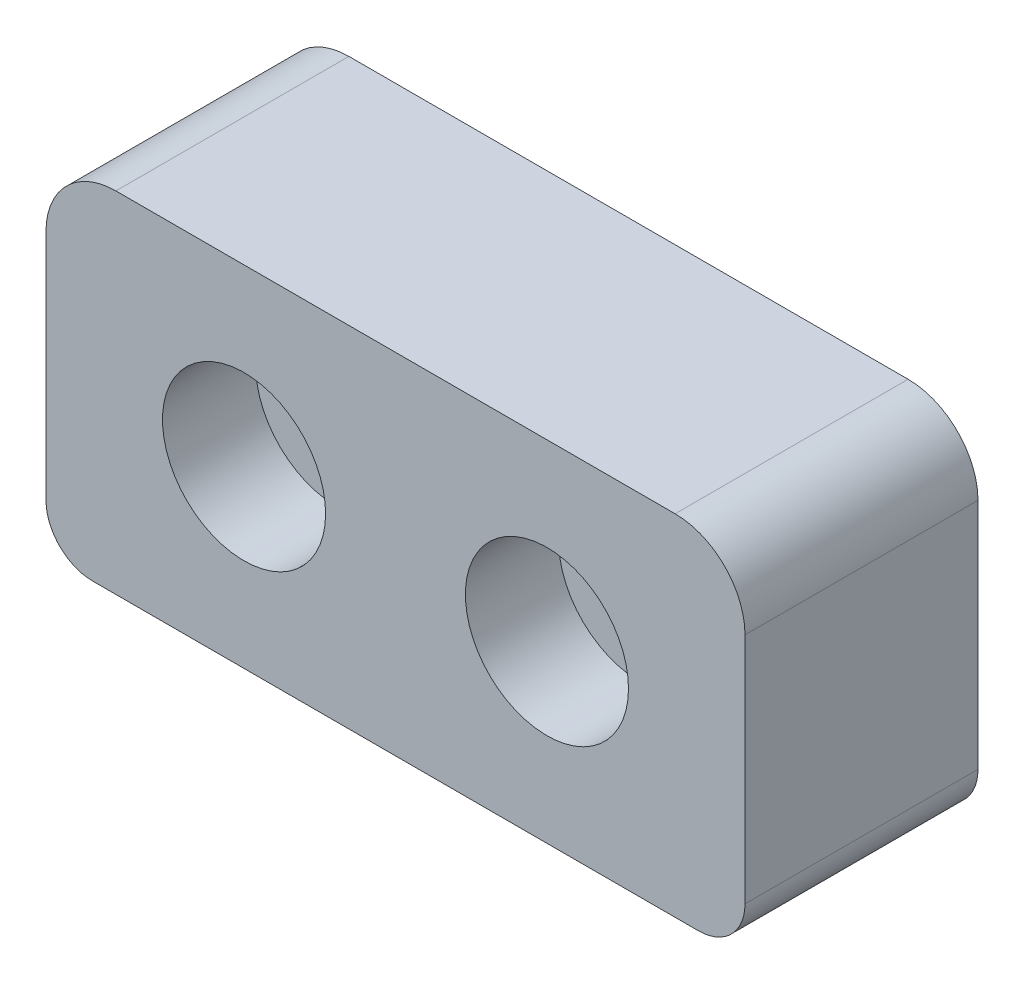
ISO-10303-21;
HEADER;
FILE_DESCRIPTION(('STEP AP214'),'2;1');
FILE_NAME('part.step','',(''),(''),'','','');
FILE_SCHEMA(('AUTOMOTIVE_DESIGN { 1 0 10303 214 1 1 1 1 }'));
ENDSEC;
DATA;
#1=APPLICATION_CONTEXT('core data for automotive mechanical design processes');
#2=APPLICATION_PROTOCOL_DEFINITION('international standard','automotive_design',2000,#1);
#3=PRODUCT_CONTEXT('',#1,'mechanical');
#4=PRODUCT('Part','Part','',(#3));
#5=PRODUCT_RELATED_PRODUCT_CATEGORY('part','',(#4));
#6=PRODUCT_DEFINITION_FORMATION('','',#4);
#7=PRODUCT_DEFINITION_CONTEXT('part definition',#1,'design');
#8=PRODUCT_DEFINITION('design','',#6,#7);
#9=PRODUCT_DEFINITION_SHAPE('','',#8);
#10=(LENGTH_UNIT() NAMED_UNIT(*) SI_UNIT(.MILLI.,.METRE.));
#11=(NAMED_UNIT(*) PLANE_ANGLE_UNIT() SI_UNIT($,.RADIAN.));
#12=(NAMED_UNIT(*) SI_UNIT($,.STERADIAN.) SOLID_ANGLE_UNIT());
#13=UNCERTAINTY_MEASURE_WITH_UNIT(LENGTH_MEASURE(1.E-05),#10,'distance_accuracy_value','');
#14=(GEOMETRIC_REPRESENTATION_CONTEXT(3) GLOBAL_UNCERTAINTY_ASSIGNED_CONTEXT((#13)) GLOBAL_UNIT_ASSIGNED_CONTEXT((#10,
#11,#12)) REPRESENTATION_CONTEXT('',''));
#15=CARTESIAN_POINT('',(0.,0.,0.));
#16=DIRECTION('',(0.,0.,1.));
#17=DIRECTION('',(1.,0.,0.));
#18=AXIS2_PLACEMENT_3D('',#15,#16,#17);
#19=CARTESIAN_POINT('',(6.5,-7.5,0.));
#20=DIRECTION('',(0.,0.,1.));
#21=DIRECTION('',(1.,0.,0.));
#22=AXIS2_PLACEMENT_3D('',#19,#20,#21);
#23=CYLINDRICAL_SURFACE('',#22,1.55);
#24=CARTESIAN_POINT('',(6.5,-7.5,0.));
#25=DIRECTION('',(0.,0.,1.));
#26=DIRECTION('',(-1.,0.,0.));
#27=AXIS2_PLACEMENT_3D('',#24,#25,#26);
#28=CIRCLE('',#27,1.55);
#29=CARTESIAN_POINT('',(4.95,-7.5,0.));
#30=VERTEX_POINT('',#29);
#31=EDGE_CURVE('E168',#30,#30,#28,.T.);
#32=ORIENTED_EDGE('',*,*,#31,.F.);
#33=EDGE_LOOP('',(#32));
#34=FACE_BOUND('',#33,.T.);
#35=CARTESIAN_POINT('',(6.5,-7.5,6.));
#36=DIRECTION('',(0.,0.,1.));
#37=DIRECTION('',(1.,0.,0.));
#38=AXIS2_PLACEMENT_3D('',#35,#36,#37);
#39=CIRCLE('',#38,1.55);
#40=CARTESIAN_POINT('',(8.05,-7.5,6.));
#41=VERTEX_POINT('',#40);
#42=EDGE_CURVE('E40',#41,#41,#39,.F.);
#43=ORIENTED_EDGE('',*,*,#42,.F.);
#44=EDGE_LOOP('',(#43));
#45=FACE_BOUND('',#44,.T.);
#46=ADVANCED_FACE('F36',(#34,#45),#23,.F.);
#47=CARTESIAN_POINT('',(-6.5,-7.5,0.));
#48=DIRECTION('',(0.,0.,1.));
#49=DIRECTION('',(1.,0.,0.));
#50=AXIS2_PLACEMENT_3D('',#47,#48,#49);
#51=CYLINDRICAL_SURFACE('',#50,1.55);
#52=CARTESIAN_POINT('',(-6.5,-7.5,0.));
#53=DIRECTION('',(0.,0.,1.));
#54=DIRECTION('',(1.,0.,0.));
#55=AXIS2_PLACEMENT_3D('',#52,#53,#54);
#56=CIRCLE('',#55,1.55);
#57=CARTESIAN_POINT('',(-4.95,-7.5,0.));
#58=VERTEX_POINT('',#57);
#59=EDGE_CURVE('E132',#58,#58,#56,.T.);
#60=ORIENTED_EDGE('',*,*,#59,.F.);
#61=EDGE_LOOP('',(#60));
#62=FACE_BOUND('',#61,.T.);
#63=CARTESIAN_POINT('',(-6.5,-7.5,6.));
#64=DIRECTION('',(0.,0.,1.));
#65=DIRECTION('',(1.,0.,0.));
#66=AXIS2_PLACEMENT_3D('',#63,#64,#65);
#67=CIRCLE('',#66,1.55);
#68=CARTESIAN_POINT('',(-4.95,-7.5,6.));
#69=VERTEX_POINT('',#68);
#70=EDGE_CURVE('E162',#69,#69,#67,.F.);
#71=ORIENTED_EDGE('',*,*,#70,.F.);
#72=EDGE_LOOP('',(#71));
#73=FACE_BOUND('',#72,.T.);
#74=ADVANCED_FACE('F221',(#62,#73),#51,.F.);
#75=CARTESIAN_POINT('',(-15.,5.,10.));
#76=DIRECTION('',(1.,0.,0.));
#77=DIRECTION('',(0.,1.,0.));
#78=AXIS2_PLACEMENT_3D('',#75,#76,#77);
#79=PLANE('',#78);
#80=DIRECTION('',(0.,-1.,0.));
#81=VECTOR('',#80,1.);
#82=CARTESIAN_POINT('',(-15.,5.,10.));
#83=LINE('',#82,#81);
#84=CARTESIAN_POINT('',(-15.,-3.,10.));
#85=VERTEX_POINT('',#84);
#86=CARTESIAN_POINT('',(-15.,-13.,10.));
#87=VERTEX_POINT('',#86);
#88=EDGE_CURVE('E137',#85,#87,#83,.T.);
#89=ORIENTED_EDGE('',*,*,#88,.F.);
#90=DIRECTION('',(0.,0.,1.));
#91=VECTOR('',#90,1.);
#92=CARTESIAN_POINT('',(-15.,-3.,10.));
#93=LINE('',#92,#91);
#94=CARTESIAN_POINT('',(-15.,-3.,0.));
#95=VERTEX_POINT('',#94);
#96=EDGE_CURVE('E11',#85,#95,#93,.F.);
#97=ORIENTED_EDGE('',*,*,#96,.T.);
#98=DIRECTION('',(0.,-1.,0.));
#99=VECTOR('',#98,1.);
#100=CARTESIAN_POINT('',(-15.,5.,0.));
#101=LINE('',#100,#99);
#102=CARTESIAN_POINT('',(-15.,-13.,0.));
#103=VERTEX_POINT('',#102);
#104=EDGE_CURVE('E127',#95,#103,#101,.T.);
#105=ORIENTED_EDGE('',*,*,#104,.T.);
#106=DIRECTION('',(0.,0.,-1.));
#107=VECTOR('',#106,1.);
#108=CARTESIAN_POINT('',(-15.,-13.,10.));
#109=LINE('',#108,#107);
#110=EDGE_CURVE('E110',#103,#87,#109,.F.);
#111=ORIENTED_EDGE('',*,*,#110,.T.);
#112=EDGE_LOOP('',(#89,#97,#105,#111));
#113=FACE_BOUND('',#112,.T.);
#114=ADVANCED_FACE('F210',(#113),#79,.F.);
#115=CARTESIAN_POINT('',(15.,-15.,10.));
#116=DIRECTION('',(0.,1.,0.));
#117=DIRECTION('',(-1.,0.,0.));
#118=AXIS2_PLACEMENT_3D('',#115,#116,#117);
#119=PLANE('',#118);
#120=DIRECTION('',(1.,0.,0.));
#121=VECTOR('',#120,1.);
#122=CARTESIAN_POINT('',(15.,-15.,10.));
#123=LINE('',#122,#121);
#124=CARTESIAN_POINT('',(-13.,-15.,10.));
#125=VERTEX_POINT('',#124);
#126=CARTESIAN_POINT('',(13.,-15.,10.));
#127=VERTEX_POINT('',#126);
#128=EDGE_CURVE('E121',#125,#127,#123,.T.);
#129=ORIENTED_EDGE('',*,*,#128,.F.);
#130=DIRECTION('',(0.,0.,-1.));
#131=VECTOR('',#130,1.);
#132=CARTESIAN_POINT('',(-13.,-15.,10.));
#133=LINE('',#132,#131);
#134=CARTESIAN_POINT('',(-13.,-15.,0.));
#135=VERTEX_POINT('',#134);
#136=EDGE_CURVE('E108',#125,#135,#133,.T.);
#137=ORIENTED_EDGE('',*,*,#136,.T.);
#138=DIRECTION('',(1.,0.,0.));
#139=VECTOR('',#138,1.);
#140=CARTESIAN_POINT('',(15.,-15.,0.));
#141=LINE('',#140,#139);
#142=CARTESIAN_POINT('',(13.,-15.,0.));
#143=VERTEX_POINT('',#142);
#144=EDGE_CURVE('E118',#135,#143,#141,.T.);
#145=ORIENTED_EDGE('',*,*,#144,.T.);
#146=DIRECTION('',(0.,0.,-1.));
#147=VECTOR('',#146,1.);
#148=CARTESIAN_POINT('',(13.,-15.,10.));
#149=LINE('',#148,#147);
#150=EDGE_CURVE('E122',#143,#127,#149,.F.);
#151=ORIENTED_EDGE('',*,*,#150,.T.);
#152=EDGE_LOOP('',(#129,#137,#145,#151));
#153=FACE_BOUND('',#152,.T.);
#154=ADVANCED_FACE('F117',(#153),#119,.F.);
#155=CARTESIAN_POINT('',(15.,5.,10.));
#156=DIRECTION('',(-1.,0.,0.));
#157=DIRECTION('',(0.,-1.,0.));
#158=AXIS2_PLACEMENT_3D('',#155,#156,#157);
#159=PLANE('',#158);
#160=DIRECTION('',(0.,1.,0.));
#161=VECTOR('',#160,1.);
#162=CARTESIAN_POINT('',(15.,5.,0.));
#163=LINE('',#162,#161);
#164=CARTESIAN_POINT('',(15.,-13.,0.));
#165=VERTEX_POINT('',#164);
#166=CARTESIAN_POINT('',(15.,-3.,0.));
#167=VERTEX_POINT('',#166);
#168=EDGE_CURVE('E126',#165,#167,#163,.T.);
#169=ORIENTED_EDGE('',*,*,#168,.T.);
#170=DIRECTION('',(0.,0.,1.));
#171=VECTOR('',#170,1.);
#172=CARTESIAN_POINT('',(15.,-3.,10.));
#173=LINE('',#172,#171);
#174=CARTESIAN_POINT('',(15.,-3.,10.));
#175=VERTEX_POINT('',#174);
#176=EDGE_CURVE('E149',#167,#175,#173,.T.);
#177=ORIENTED_EDGE('',*,*,#176,.T.);
#178=DIRECTION('',(0.,1.,0.));
#179=VECTOR('',#178,1.);
#180=CARTESIAN_POINT('',(15.,5.,10.));
#181=LINE('',#180,#179);
#182=CARTESIAN_POINT('',(15.,-13.,10.));
#183=VERTEX_POINT('',#182);
#184=EDGE_CURVE('E189',#183,#175,#181,.T.);
#185=ORIENTED_EDGE('',*,*,#184,.F.);
#186=DIRECTION('',(0.,0.,-1.));
#187=VECTOR('',#186,1.);
#188=CARTESIAN_POINT('',(15.,-13.,10.));
#189=LINE('',#188,#187);
#190=EDGE_CURVE('E146',#183,#165,#189,.T.);
#191=ORIENTED_EDGE('',*,*,#190,.T.);
#192=EDGE_LOOP('',(#169,#177,#185,#191));
#193=FACE_BOUND('',#192,.T.);
#194=ADVANCED_FACE('F204',(#193),#159,.F.);
#195=CARTESIAN_POINT('',(7.25,0.,10.));
#196=DIRECTION('',(0.,-1.,0.));
#197=DIRECTION('',(1.,0.,0.));
#198=AXIS2_PLACEMENT_3D('',#195,#196,#197);
#199=PLANE('',#198);
#200=DIRECTION('',(-1.,0.,0.));
#201=VECTOR('',#200,1.);
#202=CARTESIAN_POINT('',(7.25,0.,10.));
#203=LINE('',#202,#201);
#204=CARTESIAN_POINT('',(12.,0.,10.));
#205=VERTEX_POINT('',#204);
#206=CARTESIAN_POINT('',(-12.,0.,10.));
#207=VERTEX_POINT('',#206);
#208=EDGE_CURVE('E138',#205,#207,#203,.T.);
#209=ORIENTED_EDGE('',*,*,#208,.F.);
#210=DIRECTION('',(0.,0.,1.));
#211=VECTOR('',#210,1.);
#212=CARTESIAN_POINT('',(12.,0.,10.));
#213=LINE('',#212,#211);
#214=CARTESIAN_POINT('',(12.,0.,0.));
#215=VERTEX_POINT('',#214);
#216=EDGE_CURVE('E159',#205,#215,#213,.F.);
#217=ORIENTED_EDGE('',*,*,#216,.T.);
#218=DIRECTION('',(-1.,0.,0.));
#219=VECTOR('',#218,1.);
#220=CARTESIAN_POINT('',(7.25,0.,0.));
#221=LINE('',#220,#219);
#222=CARTESIAN_POINT('',(-12.,0.,0.));
#223=VERTEX_POINT('',#222);
#224=EDGE_CURVE('E130',#215,#223,#221,.T.);
#225=ORIENTED_EDGE('',*,*,#224,.T.);
#226=DIRECTION('',(0.,0.,1.));
#227=VECTOR('',#226,1.);
#228=CARTESIAN_POINT('',(-12.,0.,10.));
#229=LINE('',#228,#227);
#230=EDGE_CURVE('E156',#223,#207,#229,.T.);
#231=ORIENTED_EDGE('',*,*,#230,.T.);
#232=EDGE_LOOP('',(#209,#217,#225,#231));
#233=FACE_BOUND('',#232,.T.);
#234=ADVANCED_FACE('F197',(#233),#199,.F.);
#235=CARTESIAN_POINT('',(0.,0.,10.));
#236=DIRECTION('',(0.,0.,1.));
#237=DIRECTION('',(1.,0.,0.));
#238=AXIS2_PLACEMENT_3D('',#235,#236,#237);
#239=PLANE('',#238);
#240=CARTESIAN_POINT('',(-6.50000000000482,-7.50000000050165,10.));
#241=DIRECTION('',(0.,0.,1.));
#242=DIRECTION('',(1.,0.,0.));
#243=AXIS2_PLACEMENT_3D('',#240,#241,#242);
#244=CIRCLE('',#243,3.50000000007501);
#245=CARTESIAN_POINT('',(-2.9999999999298,-7.50000000050165,10.));
#246=VERTEX_POINT('',#245);
#247=EDGE_CURVE('E170',#246,#246,#244,.T.);
#248=ORIENTED_EDGE('',*,*,#247,.F.);
#249=EDGE_LOOP('',(#248));
#250=FACE_BOUND('',#249,.T.);
#251=CARTESIAN_POINT('',(6.5,-7.5,10.));
#252=DIRECTION('',(0.,0.,1.));
#253=DIRECTION('',(1.,0.,0.));
#254=AXIS2_PLACEMENT_3D('',#251,#252,#253);
#255=CIRCLE('',#254,3.5);
#256=CARTESIAN_POINT('',(10.,-7.5,10.));
#257=VERTEX_POINT('',#256);
#258=EDGE_CURVE('E180',#257,#257,#255,.T.);
#259=ORIENTED_EDGE('',*,*,#258,.F.);
#260=EDGE_LOOP('',(#259));
#261=FACE_BOUND('',#260,.T.);
#262=ORIENTED_EDGE('',*,*,#184,.T.);
#263=CARTESIAN_POINT('',(12.,-3.,10.));
#264=DIRECTION('',(0.,0.,1.));
#265=DIRECTION('',(1.,0.,0.));
#266=AXIS2_PLACEMENT_3D('',#263,#264,#265);
#267=CIRCLE('',#266,3.);
#268=EDGE_CURVE('E154',#175,#205,#267,.T.);
#269=ORIENTED_EDGE('',*,*,#268,.T.);
#270=ORIENTED_EDGE('',*,*,#208,.T.);
#271=CARTESIAN_POINT('',(-12.,-3.,10.));
#272=DIRECTION('',(0.,0.,1.));
#273=DIRECTION('',(1.,0.,0.));
#274=AXIS2_PLACEMENT_3D('',#271,#272,#273);
#275=CIRCLE('',#274,3.);
#276=EDGE_CURVE('E152',#207,#85,#275,.T.);
#277=ORIENTED_EDGE('',*,*,#276,.T.);
#278=ORIENTED_EDGE('',*,*,#88,.T.);
#279=CARTESIAN_POINT('',(-13.,-13.,10.));
#280=DIRECTION('',(0.,0.,1.));
#281=DIRECTION('',(1.,0.,0.));
#282=AXIS2_PLACEMENT_3D('',#279,#280,#281);
#283=CIRCLE('',#282,2.);
#284=EDGE_CURVE('E144',#87,#125,#283,.T.);
#285=ORIENTED_EDGE('',*,*,#284,.T.);
#286=ORIENTED_EDGE('',*,*,#128,.T.);
#287=CARTESIAN_POINT('',(13.,-13.,10.));
#288=DIRECTION('',(0.,0.,1.));
#289=DIRECTION('',(1.,0.,0.));
#290=AXIS2_PLACEMENT_3D('',#287,#288,#289);
#291=CIRCLE('',#290,2.);
#292=EDGE_CURVE('E142',#127,#183,#291,.T.);
#293=ORIENTED_EDGE('',*,*,#292,.T.);
#294=EDGE_LOOP('',(#262,#269,#270,#277,#278,#285,#286,#293));
#295=FACE_BOUND('',#294,.T.);
#296=ADVANCED_FACE('F194',(#250,#261,#295),#239,.T.);
#297=CARTESIAN_POINT('',(0.,0.,0.));
#298=DIRECTION('',(0.,0.,1.));
#299=DIRECTION('',(1.,0.,0.));
#300=AXIS2_PLACEMENT_3D('',#297,#298,#299);
#301=PLANE('',#300);
#302=ORIENTED_EDGE('',*,*,#59,.T.);
#303=EDGE_LOOP('',(#302));
#304=FACE_BOUND('',#303,.T.);
#305=ORIENTED_EDGE('',*,*,#31,.T.);
#306=EDGE_LOOP('',(#305));
#307=FACE_BOUND('',#306,.T.);
#308=ORIENTED_EDGE('',*,*,#224,.F.);
#309=CARTESIAN_POINT('',(12.,-3.,0.));
#310=DIRECTION('',(0.,0.,1.));
#311=DIRECTION('',(1.,0.,0.));
#312=AXIS2_PLACEMENT_3D('',#309,#310,#311);
#313=CIRCLE('',#312,3.);
#314=EDGE_CURVE('E45',#215,#167,#313,.F.);
#315=ORIENTED_EDGE('',*,*,#314,.T.);
#316=ORIENTED_EDGE('',*,*,#168,.F.);
#317=CARTESIAN_POINT('',(13.,-13.,0.));
#318=DIRECTION('',(0.,0.,1.));
#319=DIRECTION('',(1.,0.,0.));
#320=AXIS2_PLACEMENT_3D('',#317,#318,#319);
#321=CIRCLE('',#320,2.);
#322=EDGE_CURVE('E112',#165,#143,#321,.F.);
#323=ORIENTED_EDGE('',*,*,#322,.T.);
#324=ORIENTED_EDGE('',*,*,#144,.F.);
#325=CARTESIAN_POINT('',(-13.,-13.,0.));
#326=DIRECTION('',(0.,0.,1.));
#327=DIRECTION('',(1.,0.,0.));
#328=AXIS2_PLACEMENT_3D('',#325,#326,#327);
#329=CIRCLE('',#328,2.);
#330=EDGE_CURVE('E104',#135,#103,#329,.F.);
#331=ORIENTED_EDGE('',*,*,#330,.T.);
#332=ORIENTED_EDGE('',*,*,#104,.F.);
#333=CARTESIAN_POINT('',(-12.,-3.,0.));
#334=DIRECTION('',(0.,0.,1.));
#335=DIRECTION('',(1.,0.,0.));
#336=AXIS2_PLACEMENT_3D('',#333,#334,#335);
#337=CIRCLE('',#336,3.);
#338=EDGE_CURVE('E58',#95,#223,#337,.F.);
#339=ORIENTED_EDGE('',*,*,#338,.T.);
#340=EDGE_LOOP('',(#308,#315,#316,#323,#324,#331,#332,#339));
#341=FACE_BOUND('',#340,.T.);
#342=ADVANCED_FACE('F124',(#304,#307,#341),#301,.F.);
#343=CARTESIAN_POINT('',(-13.,-13.,10.));
#344=DIRECTION('',(0.,0.,-1.));
#345=DIRECTION('',(-1.,0.,0.));
#346=AXIS2_PLACEMENT_3D('',#343,#344,#345);
#347=CYLINDRICAL_SURFACE('',#346,2.);
#348=ORIENTED_EDGE('',*,*,#284,.F.);
#349=ORIENTED_EDGE('',*,*,#110,.F.);
#350=ORIENTED_EDGE('',*,*,#330,.F.);
#351=ORIENTED_EDGE('',*,*,#136,.F.);
#352=EDGE_LOOP('',(#348,#349,#350,#351));
#353=FACE_BOUND('',#352,.T.);
#354=ADVANCED_FACE('F107',(#353),#347,.T.);
#355=CARTESIAN_POINT('',(13.,-13.,10.));
#356=DIRECTION('',(0.,0.,-1.));
#357=DIRECTION('',(-1.,0.,0.));
#358=AXIS2_PLACEMENT_3D('',#355,#356,#357);
#359=CYLINDRICAL_SURFACE('',#358,2.);
#360=ORIENTED_EDGE('',*,*,#292,.F.);
#361=ORIENTED_EDGE('',*,*,#150,.F.);
#362=ORIENTED_EDGE('',*,*,#322,.F.);
#363=ORIENTED_EDGE('',*,*,#190,.F.);
#364=EDGE_LOOP('',(#360,#361,#362,#363));
#365=FACE_BOUND('',#364,.T.);
#366=ADVANCED_FACE('F209',(#365),#359,.T.);
#367=CARTESIAN_POINT('',(12.,-3.,10.));
#368=DIRECTION('',(0.,0.,1.));
#369=DIRECTION('',(1.,0.,0.));
#370=AXIS2_PLACEMENT_3D('',#367,#368,#369);
#371=CYLINDRICAL_SURFACE('',#370,3.);
#372=ORIENTED_EDGE('',*,*,#314,.F.);
#373=ORIENTED_EDGE('',*,*,#216,.F.);
#374=ORIENTED_EDGE('',*,*,#268,.F.);
#375=ORIENTED_EDGE('',*,*,#176,.F.);
#376=EDGE_LOOP('',(#372,#373,#374,#375));
#377=FACE_BOUND('',#376,.T.);
#378=ADVANCED_FACE('F201',(#377),#371,.T.);
#379=CARTESIAN_POINT('',(-12.,-3.,10.));
#380=DIRECTION('',(0.,0.,1.));
#381=DIRECTION('',(1.,0.,0.));
#382=AXIS2_PLACEMENT_3D('',#379,#380,#381);
#383=CYLINDRICAL_SURFACE('',#382,3.);
#384=ORIENTED_EDGE('',*,*,#338,.F.);
#385=ORIENTED_EDGE('',*,*,#96,.F.);
#386=ORIENTED_EDGE('',*,*,#276,.F.);
#387=ORIENTED_EDGE('',*,*,#230,.F.);
#388=EDGE_LOOP('',(#384,#385,#386,#387));
#389=FACE_BOUND('',#388,.T.);
#390=ADVANCED_FACE('F38',(#389),#383,.T.);
#391=CARTESIAN_POINT('',(-6.50000000000482,-7.50000000050165,6.));
#392=DIRECTION('',(0.,0.,1.));
#393=DIRECTION('',(1.,0.,0.));
#394=AXIS2_PLACEMENT_3D('',#391,#392,#393);
#395=PLANE('',#394);
#396=CARTESIAN_POINT('',(-6.50000000000482,-7.50000000050165,6.));
#397=DIRECTION('',(0.,0.,1.));
#398=DIRECTION('',(1.,0.,0.));
#399=AXIS2_PLACEMENT_3D('',#396,#397,#398);
#400=CIRCLE('',#399,3.50000000007501);
#401=CARTESIAN_POINT('',(-2.9999999999298,-7.50000000050165,6.));
#402=VERTEX_POINT('',#401);
#403=EDGE_CURVE('E164',#402,#402,#400,.T.);
#404=ORIENTED_EDGE('',*,*,#403,.T.);
#405=EDGE_LOOP('',(#404));
#406=FACE_BOUND('',#405,.T.);
#407=ORIENTED_EDGE('',*,*,#70,.T.);
#408=EDGE_LOOP('',(#407));
#409=FACE_BOUND('',#408,.T.);
#410=ADVANCED_FACE('F213',(#406,#409),#395,.T.);
#411=CARTESIAN_POINT('',(-6.50000000000482,-7.50000000050165,6.));
#412=DIRECTION('',(0.,0.,1.));
#413=DIRECTION('',(1.,0.,0.));
#414=AXIS2_PLACEMENT_3D('',#411,#412,#413);
#415=CYLINDRICAL_SURFACE('',#414,3.50000000007501);
#416=ORIENTED_EDGE('',*,*,#403,.F.);
#417=EDGE_LOOP('',(#416));
#418=FACE_BOUND('',#417,.T.);
#419=ORIENTED_EDGE('',*,*,#247,.T.);
#420=EDGE_LOOP('',(#419));
#421=FACE_BOUND('',#420,.T.);
#422=ADVANCED_FACE('F218',(#418,#421),#415,.F.);
#423=CARTESIAN_POINT('',(6.5,-7.5,6.));
#424=DIRECTION('',(0.,0.,1.));
#425=DIRECTION('',(1.,0.,0.));
#426=AXIS2_PLACEMENT_3D('',#423,#424,#425);
#427=PLANE('',#426);
#428=CARTESIAN_POINT('',(6.5,-7.5,6.));
#429=DIRECTION('',(0.,0.,1.));
#430=DIRECTION('',(1.,0.,0.));
#431=AXIS2_PLACEMENT_3D('',#428,#429,#430);
#432=CIRCLE('',#431,3.5);
#433=CARTESIAN_POINT('',(10.,-7.5,6.));
#434=VERTEX_POINT('',#433);
#435=EDGE_CURVE('E175',#434,#434,#432,.T.);
#436=ORIENTED_EDGE('',*,*,#435,.T.);
#437=EDGE_LOOP('',(#436));
#438=FACE_BOUND('',#437,.T.);
#439=ORIENTED_EDGE('',*,*,#42,.T.);
#440=EDGE_LOOP('',(#439));
#441=FACE_BOUND('',#440,.T.);
#442=ADVANCED_FACE('F300',(#438,#441),#427,.T.);
#443=CARTESIAN_POINT('',(6.5,-7.5,6.));
#444=DIRECTION('',(0.,0.,1.));
#445=DIRECTION('',(1.,0.,0.));
#446=AXIS2_PLACEMENT_3D('',#443,#444,#445);
#447=CYLINDRICAL_SURFACE('',#446,3.5);
#448=ORIENTED_EDGE('',*,*,#435,.F.);
#449=EDGE_LOOP('',(#448));
#450=FACE_BOUND('',#449,.T.);
#451=ORIENTED_EDGE('',*,*,#258,.T.);
#452=EDGE_LOOP('',(#451));
#453=FACE_BOUND('',#452,.T.);
#454=ADVANCED_FACE('F310',(#450,#453),#447,.F.);
#455=CLOSED_SHELL('',(#46,#74,#114,#154,#194,#234,#296,#342,#354,#366,#378,#390,#410,#422,#442,#454));
#456=MANIFOLD_SOLID_BREP('B2',#455);
#457=ADVANCED_BREP_SHAPE_REPRESENTATION('',(#18,#456),#14);
#458=SHAPE_DEFINITION_REPRESENTATION(#9,#457);
ENDSEC;
END-ISO-10303-21;
